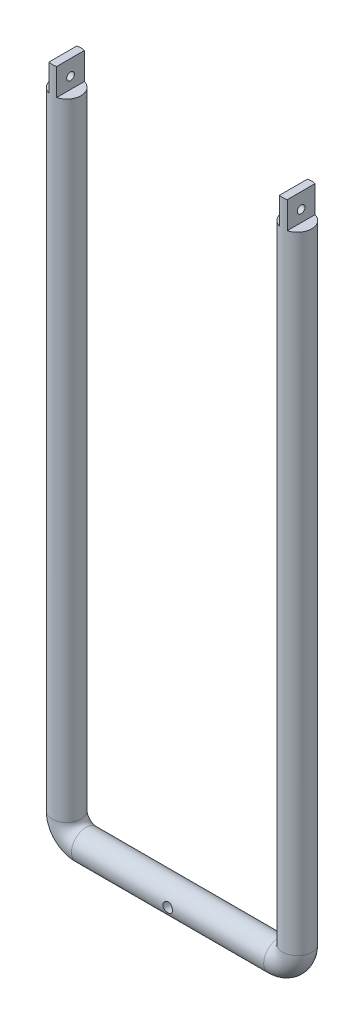
ISO-10303-21;
HEADER;
FILE_DESCRIPTION(('STEP AP214'),'2;1');
FILE_NAME('part.step','',(''),(''),'','','');
FILE_SCHEMA(('AUTOMOTIVE_DESIGN { 1 0 10303 214 1 1 1 1 }'));
ENDSEC;
DATA;
#1=APPLICATION_CONTEXT('core data for automotive mechanical design processes');
#2=APPLICATION_PROTOCOL_DEFINITION('international standard','automotive_design',2000,#1);
#3=PRODUCT_CONTEXT('',#1,'mechanical');
#4=PRODUCT('Part','Part','',(#3));
#5=PRODUCT_RELATED_PRODUCT_CATEGORY('part','',(#4));
#6=PRODUCT_DEFINITION_FORMATION('','',#4);
#7=PRODUCT_DEFINITION_CONTEXT('part definition',#1,'design');
#8=PRODUCT_DEFINITION('design','',#6,#7);
#9=PRODUCT_DEFINITION_SHAPE('','',#8);
#10=(LENGTH_UNIT() NAMED_UNIT(*) SI_UNIT(.MILLI.,.METRE.));
#11=(NAMED_UNIT(*) PLANE_ANGLE_UNIT() SI_UNIT($,.RADIAN.));
#12=(NAMED_UNIT(*) SI_UNIT($,.STERADIAN.) SOLID_ANGLE_UNIT());
#13=UNCERTAINTY_MEASURE_WITH_UNIT(LENGTH_MEASURE(1.E-05),#10,'distance_accuracy_value','');
#14=(GEOMETRIC_REPRESENTATION_CONTEXT(3) GLOBAL_UNCERTAINTY_ASSIGNED_CONTEXT((#13)) GLOBAL_UNIT_ASSIGNED_CONTEXT((#10,
#11,#12)) REPRESENTATION_CONTEXT('',''));
#15=CARTESIAN_POINT('',(0.,0.,0.));
#16=DIRECTION('',(0.,0.,1.));
#17=DIRECTION('',(1.,0.,0.));
#18=AXIS2_PLACEMENT_3D('',#15,#16,#17);
#19=CARTESIAN_POINT('',(-60.,350.,0.));
#20=DIRECTION('',(0.,1.,0.));
#21=DIRECTION('',(0.,0.,-1.));
#22=AXIS2_PLACEMENT_3D('',#19,#20,#21);
#23=PLANE('',#22);
#24=DIRECTION('',(0.,0.,1.));
#25=VECTOR('',#24,1.);
#26=CARTESIAN_POINT('',(-62.,350.,-7.5));
#27=LINE('',#26,#25);
#28=CARTESIAN_POINT('',(-62.,350.,-7.22841614740048));
#29=VERTEX_POINT('',#28);
#30=CARTESIAN_POINT('',(-62.,350.,7.22841614740048));
#31=VERTEX_POINT('',#30);
#32=EDGE_CURVE('E259',#29,#31,#27,.T.);
#33=ORIENTED_EDGE('',*,*,#32,.T.);
#34=CARTESIAN_POINT('',(-60.,350.,0.));
#35=DIRECTION('',(0.,1.,0.));
#36=DIRECTION('',(0.,0.,-1.));
#37=AXIS2_PLACEMENT_3D('',#34,#35,#36);
#38=CIRCLE('',#37,7.5);
#39=CARTESIAN_POINT('',(-58.,350.,7.22841614740046));
#40=VERTEX_POINT('',#39);
#41=EDGE_CURVE('E261',#31,#40,#38,.T.);
#42=ORIENTED_EDGE('',*,*,#41,.T.);
#43=DIRECTION('',(0.,0.,1.));
#44=VECTOR('',#43,1.);
#45=CARTESIAN_POINT('',(-58.,350.,-7.5));
#46=LINE('',#45,#44);
#47=CARTESIAN_POINT('',(-58.,350.,-7.22841614740046));
#48=VERTEX_POINT('',#47);
#49=EDGE_CURVE('E77',#48,#40,#46,.T.);
#50=ORIENTED_EDGE('',*,*,#49,.F.);
#51=EDGE_CURVE('E263',#48,#29,#38,.T.);
#52=ORIENTED_EDGE('',*,*,#51,.T.);
#53=EDGE_LOOP('',(#33,#42,#50,#52));
#54=FACE_BOUND('',#53,.T.);
#55=ADVANCED_FACE('F49',(#54),#23,.T.);
#56=CARTESIAN_POINT('',(60.,350.,0.));
#57=DIRECTION('',(0.,-1.,0.));
#58=DIRECTION('',(0.,0.,-1.));
#59=AXIS2_PLACEMENT_3D('',#56,#57,#58);
#60=PLANE('',#59);
#61=CARTESIAN_POINT('',(60.,350.,0.));
#62=DIRECTION('',(0.,-1.,0.));
#63=DIRECTION('',(0.,0.,-1.));
#64=AXIS2_PLACEMENT_3D('',#61,#62,#63);
#65=CIRCLE('',#64,7.5);
#66=CARTESIAN_POINT('',(58.,350.,-7.22841614740047));
#67=VERTEX_POINT('',#66);
#68=CARTESIAN_POINT('',(62.,350.,-7.22841614740048));
#69=VERTEX_POINT('',#68);
#70=EDGE_CURVE('E138',#67,#69,#65,.T.);
#71=ORIENTED_EDGE('',*,*,#70,.F.);
#72=DIRECTION('',(0.,0.,1.));
#73=VECTOR('',#72,1.);
#74=CARTESIAN_POINT('',(58.,350.,-7.5));
#75=LINE('',#74,#73);
#76=CARTESIAN_POINT('',(58.,350.,7.22841614740047));
#77=VERTEX_POINT('',#76);
#78=EDGE_CURVE('E281',#67,#77,#75,.T.);
#79=ORIENTED_EDGE('',*,*,#78,.T.);
#80=CARTESIAN_POINT('',(62.,350.,7.22841614740048));
#81=VERTEX_POINT('',#80);
#82=EDGE_CURVE('E140',#81,#77,#65,.T.);
#83=ORIENTED_EDGE('',*,*,#82,.F.);
#84=DIRECTION('',(0.,0.,1.));
#85=VECTOR('',#84,1.);
#86=CARTESIAN_POINT('',(62.,350.,-7.5));
#87=LINE('',#86,#85);
#88=EDGE_CURVE('E123',#69,#81,#87,.T.);
#89=ORIENTED_EDGE('',*,*,#88,.F.);
#90=EDGE_LOOP('',(#71,#79,#83,#89));
#91=FACE_BOUND('',#90,.T.);
#92=ADVANCED_FACE('F136',(#91),#60,.F.);
#93=CARTESIAN_POINT('',(-60.,350.,0.));
#94=DIRECTION('',(0.,-1.,0.));
#95=DIRECTION('',(1.,0.,0.));
#96=AXIS2_PLACEMENT_3D('',#93,#94,#95);
#97=CYLINDRICAL_SURFACE('',#96,7.5);
#98=CARTESIAN_POINT('',(-60.,10.,0.));
#99=DIRECTION('',(0.,1.,0.));
#100=DIRECTION('',(0.,0.,-1.));
#101=AXIS2_PLACEMENT_3D('',#98,#99,#100);
#102=CIRCLE('',#101,7.5);
#103=CARTESIAN_POINT('',(-67.4999999999999,10.,0.));
#104=VERTEX_POINT('',#103);
#105=EDGE_CURVE('E267',#104,#104,#102,.T.);
#106=ORIENTED_EDGE('',*,*,#105,.T.);
#107=EDGE_LOOP('',(#106));
#108=FACE_BOUND('',#107,.T.);
#109=ORIENTED_EDGE('',*,*,#41,.F.);
#110=DIRECTION('',(0.,-1.,0.));
#111=VECTOR('',#110,1.);
#112=CARTESIAN_POINT('',(-62.,350.,7.22841614740048));
#113=LINE('',#112,#111);
#114=CARTESIAN_POINT('',(-62.,336.,7.22841614740048));
#115=VERTEX_POINT('',#114);
#116=EDGE_CURVE('E12',#31,#115,#113,.T.);
#117=ORIENTED_EDGE('',*,*,#116,.T.);
#118=CARTESIAN_POINT('',(-60.,336.,0.));
#119=DIRECTION('',(0.,-1.,0.));
#120=DIRECTION('',(0.,0.,-1.));
#121=AXIS2_PLACEMENT_3D('',#118,#119,#120);
#122=CIRCLE('',#121,7.5);
#123=CARTESIAN_POINT('',(-62.,336.,-7.22841614740048));
#124=VERTEX_POINT('',#123);
#125=EDGE_CURVE('E172',#115,#124,#122,.T.);
#126=ORIENTED_EDGE('',*,*,#125,.T.);
#127=DIRECTION('',(0.,-1.,0.));
#128=VECTOR('',#127,1.);
#129=CARTESIAN_POINT('',(-62.,350.,-7.22841614740048));
#130=LINE('',#129,#128);
#131=EDGE_CURVE('E62',#124,#29,#130,.F.);
#132=ORIENTED_EDGE('',*,*,#131,.T.);
#133=ORIENTED_EDGE('',*,*,#51,.F.);
#134=DIRECTION('',(0.,-1.,0.));
#135=VECTOR('',#134,1.);
#136=CARTESIAN_POINT('',(-58.,350.,-7.22841614740046));
#137=LINE('',#136,#135);
#138=CARTESIAN_POINT('',(-58.,336.,-7.22841614740046));
#139=VERTEX_POINT('',#138);
#140=EDGE_CURVE('E169',#48,#139,#137,.T.);
#141=ORIENTED_EDGE('',*,*,#140,.T.);
#142=CARTESIAN_POINT('',(-60.,336.,0.));
#143=DIRECTION('',(0.,-1.,0.));
#144=DIRECTION('',(0.,0.,-1.));
#145=AXIS2_PLACEMENT_3D('',#142,#143,#144);
#146=CIRCLE('',#145,7.5);
#147=CARTESIAN_POINT('',(-58.,336.,7.22841614740046));
#148=VERTEX_POINT('',#147);
#149=EDGE_CURVE('E166',#139,#148,#146,.T.);
#150=ORIENTED_EDGE('',*,*,#149,.T.);
#151=DIRECTION('',(0.,-1.,0.));
#152=VECTOR('',#151,1.);
#153=CARTESIAN_POINT('',(-58.,350.,7.22841614740046));
#154=LINE('',#153,#152);
#155=EDGE_CURVE('E164',#148,#40,#154,.F.);
#156=ORIENTED_EDGE('',*,*,#155,.T.);
#157=EDGE_LOOP('',(#109,#117,#126,#132,#133,#141,#150,#156));
#158=FACE_BOUND('',#157,.T.);
#159=ADVANCED_FACE('F230',(#108,#158),#97,.T.);
#160=CARTESIAN_POINT('',(-50.,10.,0.));
#161=DIRECTION('',(0.,0.,1.));
#162=DIRECTION('',(1.,0.,0.));
#163=AXIS2_PLACEMENT_3D('',#160,#161,#162);
#164=TOROIDAL_SURFACE('',#163,10.,7.5);
#165=CARTESIAN_POINT('',(-49.9999999999999,0.,0.));
#166=DIRECTION('',(-1.,0.,0.));
#167=DIRECTION('',(0.,0.,-1.));
#168=AXIS2_PLACEMENT_3D('',#165,#166,#167);
#169=CIRCLE('',#168,7.5);
#170=CARTESIAN_POINT('',(-49.9999999999999,-7.5,0.));
#171=VERTEX_POINT('',#170);
#172=EDGE_CURVE('E270',#171,#171,#169,.T.);
#173=CARTESIAN_POINT('',(-50.,10.,0.));
#174=DIRECTION('',(0.,0.,1.));
#175=DIRECTION('',(1.,0.,0.));
#176=AXIS2_PLACEMENT_3D('',#173,#174,#175);
#177=CIRCLE('',#176,17.5);
#178=EDGE_CURVE('',#104,#171,#177,.T.);
#179=ORIENTED_EDGE('',*,*,#105,.F.);
#180=ORIENTED_EDGE('',*,*,#172,.T.);
#181=ORIENTED_EDGE('',*,*,#178,.T.);
#182=ORIENTED_EDGE('',*,*,#178,.F.);
#183=EDGE_LOOP('',(#179,#181,#180,#182));
#184=FACE_BOUND('',#183,.T.);
#185=ADVANCED_FACE('F232',(#184),#164,.T.);
#186=CARTESIAN_POINT('',(-49.9999999999999,0.,0.));
#187=DIRECTION('',(1.,0.,0.));
#188=DIRECTION('',(0.,0.,-1.));
#189=AXIS2_PLACEMENT_3D('',#186,#187,#188);
#190=CYLINDRICAL_SURFACE('',#189,7.5);
#191=CARTESIAN_POINT('',(-2.5,0.,-7.5));
#192=CARTESIAN_POINT('',(-2.5000006343291,-0.136408407216808,-7.5000003825236));
#193=CARTESIAN_POINT('',(-2.48879933468196,-0.272812986346375,-7.49624423768862));
#194=CARTESIAN_POINT('',(-2.44442722795695,-0.541604402182431,-7.48163025508202));
#195=CARTESIAN_POINT('',(-2.41125414012769,-0.673990820297044,-7.47077168005381));
#196=CARTESIAN_POINT('',(-2.32420189153988,-0.93083197375444,-7.44313269766107));
#197=CARTESIAN_POINT('',(-2.27035734385182,-1.05529956471509,-7.42636219327133));
#198=CARTESIAN_POINT('',(-2.14364706790413,-1.29343734201331,-7.38861114293354));
#199=CARTESIAN_POINT('',(-2.0707775874935,-1.40710539239676,-7.36762976669445));
#200=CARTESIAN_POINT('',(-1.90543548785312,-1.62435418755567,-7.32285236107513));
#201=CARTESIAN_POINT('',(-1.81242191434877,-1.72750925074577,-7.29898891159462));
#202=CARTESIAN_POINT('',(-1.61058211323359,-1.91708173175521,-7.25150786957804));
#203=CARTESIAN_POINT('',(-1.50175241267872,-2.00349546372366,-7.22789033226373));
#204=CARTESIAN_POINT('',(-1.26753721200885,-2.15956235556965,-7.18283331193184));
#205=CARTESIAN_POINT('',(-1.14176565066969,-2.22866214555258,-7.1614759818922));
#206=CARTESIAN_POINT('',(-0.879559763853633,-2.3445471846943,-7.12438263546503));
#207=CARTESIAN_POINT('',(-0.74312870709314,-2.39133924346691,-7.10864490401864));
#208=CARTESIAN_POINT('',(-0.468316946258224,-2.45968365377291,-7.08528258173443));
#209=CARTESIAN_POINT('',(-0.330156978777339,-2.48203362067942,-7.07740239424028));
#210=CARTESIAN_POINT('',(-0.0518406146102978,-2.50335280833619,-7.06989141573769));
#211=CARTESIAN_POINT('',(0.0883151517729761,-2.5023292540118,-7.07025807556825));
#212=CARTESIAN_POINT('',(0.359841576110053,-2.47754975925855,-7.0789753752045));
#213=CARTESIAN_POINT('',(0.491321007297547,-2.45483478291749,-7.08696039668832));
#214=CARTESIAN_POINT('',(0.748483549017086,-2.38901540712354,-7.10941644311377));
#215=CARTESIAN_POINT('',(0.874165963587675,-2.34590856647968,-7.12388824460269));
#216=CARTESIAN_POINT('',(1.1185318739787,-2.23984764515053,-7.15794777828122));
#217=CARTESIAN_POINT('',(1.23707006367381,-2.17658512176816,-7.17761414482793));
#218=CARTESIAN_POINT('',(1.46217727069932,-2.03222276575785,-7.21981396439316));
#219=CARTESIAN_POINT('',(1.56874281733345,-1.95111778091001,-7.24234824476159));
#220=CARTESIAN_POINT('',(1.77272899540193,-1.76837333170559,-7.28918322919352));
#221=CARTESIAN_POINT('',(1.86938173627267,-1.66588287519078,-7.31351473387107));
#222=CARTESIAN_POINT('',(2.04432816665849,-1.44584892492516,-7.36017345967592));
#223=CARTESIAN_POINT('',(2.12262009541124,-1.32830398915204,-7.38250048845168));
#224=CARTESIAN_POINT('',(2.25924075058767,-1.07986903261567,-7.42292769844484));
#225=CARTESIAN_POINT('',(2.31736372835183,-0.948858191040841,-7.44098375020098));
#226=CARTESIAN_POINT('',(2.41050793488928,-0.678172708411269,-7.47051417861087));
#227=CARTESIAN_POINT('',(2.44553718855859,-0.538501095387384,-7.48199084137198));
#228=CARTESIAN_POINT('',(2.4901391650559,-0.260959573823259,-7.49669067678601));
#229=CARTESIAN_POINT('',(2.50074952293188,-0.123273999662115,-7.5002500458432));
#230=CARTESIAN_POINT('',(2.49916831600383,0.151937674900594,-7.49972256737068));
#231=CARTESIAN_POINT('',(2.48698060005031,0.289463798299126,-7.49563701048406));
#232=CARTESIAN_POINT('',(2.4409702306601,0.556299665760639,-7.48050061792761));
#233=CARTESIAN_POINT('',(2.40778448487626,0.685732017087109,-7.46965496777981));
#234=CARTESIAN_POINT('',(2.32151638883318,0.937139896448934,-7.44229617075175));
#235=CARTESIAN_POINT('',(2.26843150133054,1.05911447127152,-7.42578230116688));
#236=CARTESIAN_POINT('',(2.14232392039803,1.29572074098318,-7.38822328218224));
#237=CARTESIAN_POINT('',(2.06881351679207,1.41007489804287,-7.36707036889465));
#238=CARTESIAN_POINT('',(1.90451462496629,1.62516207533897,-7.32263134790656));
#239=CARTESIAN_POINT('',(1.81372085992059,1.72589091948894,-7.29934458984569));
#240=CARTESIAN_POINT('',(1.61255312248353,1.91563126951575,-7.25192119951112));
#241=CARTESIAN_POINT('',(1.50147693268285,2.00390242311443,-7.2277940271857));
#242=CARTESIAN_POINT('',(1.26557108047278,2.16064380580894,-7.18249933236772));
#243=CARTESIAN_POINT('',(1.14074130341481,2.22911386982753,-7.16133183455006));
#244=CARTESIAN_POINT('',(0.88081746177526,2.3439923260409,-7.12455979478459));
#245=CARTESIAN_POINT('',(0.745744802078085,2.39044533041255,-7.10894401982447));
#246=CARTESIAN_POINT('',(0.469053374889673,2.45973666689839,-7.08527080766124));
#247=CARTESIAN_POINT('',(0.327437586489126,2.48258563738485,-7.07720996559098));
#248=CARTESIAN_POINT('',(0.049507259897709,2.50319070619335,-7.06994647185443));
#249=CARTESIAN_POINT('',(-0.0867058507170585,2.502175643271,-7.07031000643538));
#250=CARTESIAN_POINT('',(-0.356912687305157,2.47810573362173,-7.07878174559668));
#251=CARTESIAN_POINT('',(-0.490906544887722,2.45505219864646,-7.08688948923404));
#252=CARTESIAN_POINT('',(-0.750339157506181,2.38842953282336,-7.10961310762229));
#253=CARTESIAN_POINT('',(-0.875892062511242,2.34525836503879,-7.12410245056194));
#254=CARTESIAN_POINT('',(-1.11806851734567,2.23994841439937,-7.15790997046171));
#255=CARTESIAN_POINT('',(-1.23469007797002,2.17780542138451,-7.17722921908483));
#256=CARTESIAN_POINT('',(-1.46120917480728,2.03315173145857,-7.21957073065116));
#257=CARTESIAN_POINT('',(-1.57059125474596,1.94987060691145,-7.24271779105343));
#258=CARTESIAN_POINT('',(-1.7742245334605,1.76660720783912,-7.28958390708132));
#259=CARTESIAN_POINT('',(-1.86847143922019,1.6666202111287,-7.31330312280931));
#260=CARTESIAN_POINT('',(-2.04286103072295,1.44810389230172,-7.3597507631386));
#261=CARTESIAN_POINT('',(-2.1223108693775,1.32900378374932,-7.38240454503142));
#262=CARTESIAN_POINT('',(-2.25997607212662,1.07839339351656,-7.4231497793153));
#263=CARTESIAN_POINT('',(-2.31819686480511,0.946886295330871,-7.44124239769824));
#264=CARTESIAN_POINT('',(-2.40930408122168,0.681234118002439,-7.47013787671355));
#265=CARTESIAN_POINT('',(-2.44320616565844,0.547469394191021,-7.48123031056307));
#266=CARTESIAN_POINT('',(-2.48855070169282,0.275801040025617,-7.49616017660554));
#267=CARTESIAN_POINT('',(-2.49999935874134,0.137898563921866,-7.49999961329762));
#268=CARTESIAN_POINT('',(-2.5,0.,-7.5));
#269=B_SPLINE_CURVE_WITH_KNOTS('',3,(#191,#192,#193,#194,#195,#196,#197,#198,#199,#200,#201,
#202,#203,#204,#205,#206,#207,#208,#209,#210,#211,#212,#213,#214,#215,#216,#217,#218,#219,#220,
#221,#222,#223,#224,#225,#226,#227,#228,#229,#230,#231,#232,#233,#234,#235,#236,#237,#238,#239,
#240,#241,#242,#243,#244,#245,#246,#247,#248,#249,#250,#251,#252,#253,#254,#255,#256,#257,#258,
#259,#260,#261,#262,#263,#264,#265,#266,#267,#268),.UNSPECIFIED.,.T.,.F.,(4,2,2,2,2,2,2,2,2,2,2,
2,2,2,2,2,2,2,2,2,2,2,2,2,2,2,2,2,2,2,2,2,2,2,2,2,2,2,4),(0.,0.408717765065027,
0.817477963168802,1.22555668217568,1.63371594449775,2.0546171070689,2.47561083218826,
2.90870962058676,3.34167611732083,3.760048143546,4.17829084968714,4.57742066378201,
4.97659827138705,5.38220427887827,5.78792756395518,6.21483264528417,6.64177864916546,
7.07296014125894,7.50399172193021,7.91633957937924,8.32861782910441,8.72895394945534,
9.1293411321026,9.54025999609341,9.95130452054728,10.3810255720188,10.8107502058749,
11.2396003456693,11.668257117646,12.0748916516065,12.4815019837844,12.8803896770104,
13.2793659543994,13.6957516672951,14.1122552780945,14.5449915208775,14.9776170288114,
15.3909139593453,15.8040966509535),.UNSPECIFIED.);
#270=CARTESIAN_POINT('',(-2.5,0.,-7.5));
#271=VERTEX_POINT('',#270);
#272=EDGE_CURVE('E52',#271,#271,#269,.T.);
#273=ORIENTED_EDGE('',*,*,#272,.T.);
#274=EDGE_LOOP('',(#273));
#275=FACE_BOUND('',#274,.T.);
#276=CARTESIAN_POINT('',(2.5,0.,7.5));
#277=CARTESIAN_POINT('',(2.5000006343291,-0.136408407216808,7.5000003825236));
#278=CARTESIAN_POINT('',(2.48879933468196,-0.272812986346375,7.49624423768862));
#279=CARTESIAN_POINT('',(2.44442722795695,-0.541604402182431,7.48163025508202));
#280=CARTESIAN_POINT('',(2.41125414012769,-0.673990820297044,7.47077168005381));
#281=CARTESIAN_POINT('',(2.32420189153988,-0.93083197375444,7.44313269766107));
#282=CARTESIAN_POINT('',(2.27035734385182,-1.05529956471509,7.42636219327133));
#283=CARTESIAN_POINT('',(2.14364706790413,-1.29343734201331,7.38861114293354));
#284=CARTESIAN_POINT('',(2.0707775874935,-1.40710539239676,7.36762976669445));
#285=CARTESIAN_POINT('',(1.90543548785312,-1.62435418755567,7.32285236107513));
#286=CARTESIAN_POINT('',(1.81242191434877,-1.72750925074577,7.29898891159462));
#287=CARTESIAN_POINT('',(1.61058211323359,-1.91708173175521,7.25150786957804));
#288=CARTESIAN_POINT('',(1.50175241267872,-2.00349546372366,7.22789033226373));
#289=CARTESIAN_POINT('',(1.26753721200885,-2.15956235556965,7.18283331193184));
#290=CARTESIAN_POINT('',(1.14176565066969,-2.22866214555258,7.1614759818922));
#291=CARTESIAN_POINT('',(0.879559763853633,-2.3445471846943,7.12438263546503));
#292=CARTESIAN_POINT('',(0.74312870709314,-2.39133924346691,7.10864490401864));
#293=CARTESIAN_POINT('',(0.468316946258224,-2.45968365377291,7.08528258173443));
#294=CARTESIAN_POINT('',(0.330156978777339,-2.48203362067942,7.07740239424028));
#295=CARTESIAN_POINT('',(0.0518406146102978,-2.50335280833619,7.06989141573769));
#296=CARTESIAN_POINT('',(-0.0883151517729761,-2.5023292540118,7.07025807556825));
#297=CARTESIAN_POINT('',(-0.359841576110053,-2.47754975925855,7.0789753752045));
#298=CARTESIAN_POINT('',(-0.491321007297547,-2.45483478291749,7.08696039668832));
#299=CARTESIAN_POINT('',(-0.748483549017086,-2.38901540712354,7.10941644311377));
#300=CARTESIAN_POINT('',(-0.874165963587675,-2.34590856647968,7.12388824460269));
#301=CARTESIAN_POINT('',(-1.1185318739787,-2.23984764515053,7.15794777828122));
#302=CARTESIAN_POINT('',(-1.23707006367381,-2.17658512176816,7.17761414482793));
#303=CARTESIAN_POINT('',(-1.46217727069932,-2.03222276575785,7.21981396439316));
#304=CARTESIAN_POINT('',(-1.56874281733345,-1.95111778091001,7.24234824476159));
#305=CARTESIAN_POINT('',(-1.77272899540193,-1.76837333170559,7.28918322919352));
#306=CARTESIAN_POINT('',(-1.86938173627267,-1.66588287519078,7.31351473387107));
#307=CARTESIAN_POINT('',(-2.04432816665849,-1.44584892492516,7.36017345967592));
#308=CARTESIAN_POINT('',(-2.12262009541124,-1.32830398915204,7.38250048845168));
#309=CARTESIAN_POINT('',(-2.25924075058767,-1.07986903261567,7.42292769844484));
#310=CARTESIAN_POINT('',(-2.31736372835183,-0.948858191040841,7.44098375020098));
#311=CARTESIAN_POINT('',(-2.41050793488928,-0.678172708411269,7.47051417861087));
#312=CARTESIAN_POINT('',(-2.44553718855859,-0.538501095387384,7.48199084137198));
#313=CARTESIAN_POINT('',(-2.4901391650559,-0.260959573823259,7.49669067678601));
#314=CARTESIAN_POINT('',(-2.50074952293188,-0.123273999662115,7.5002500458432));
#315=CARTESIAN_POINT('',(-2.49916831600383,0.151937674900594,7.49972256737068));
#316=CARTESIAN_POINT('',(-2.48698060005031,0.289463798299126,7.49563701048406));
#317=CARTESIAN_POINT('',(-2.4409702306601,0.556299665760639,7.48050061792761));
#318=CARTESIAN_POINT('',(-2.40778448487626,0.685732017087109,7.46965496777981));
#319=CARTESIAN_POINT('',(-2.32151638883318,0.937139896448934,7.44229617075175));
#320=CARTESIAN_POINT('',(-2.26843150133054,1.05911447127152,7.42578230116688));
#321=CARTESIAN_POINT('',(-2.14232392039803,1.29572074098318,7.38822328218224));
#322=CARTESIAN_POINT('',(-2.06881351679207,1.41007489804287,7.36707036889465));
#323=CARTESIAN_POINT('',(-1.90451462496629,1.62516207533897,7.32263134790656));
#324=CARTESIAN_POINT('',(-1.81372085992059,1.72589091948894,7.29934458984569));
#325=CARTESIAN_POINT('',(-1.61255312248353,1.91563126951575,7.25192119951112));
#326=CARTESIAN_POINT('',(-1.50147693268285,2.00390242311443,7.2277940271857));
#327=CARTESIAN_POINT('',(-1.26557108047278,2.16064380580894,7.18249933236772));
#328=CARTESIAN_POINT('',(-1.14074130341481,2.22911386982753,7.16133183455006));
#329=CARTESIAN_POINT('',(-0.88081746177526,2.3439923260409,7.12455979478459));
#330=CARTESIAN_POINT('',(-0.745744802078085,2.39044533041255,7.10894401982447));
#331=CARTESIAN_POINT('',(-0.469053374889673,2.45973666689839,7.08527080766124));
#332=CARTESIAN_POINT('',(-0.327437586489126,2.48258563738485,7.07720996559098));
#333=CARTESIAN_POINT('',(-0.049507259897709,2.50319070619335,7.06994647185443));
#334=CARTESIAN_POINT('',(0.0867058507170585,2.502175643271,7.07031000643538));
#335=CARTESIAN_POINT('',(0.356912687305157,2.47810573362173,7.07878174559668));
#336=CARTESIAN_POINT('',(0.490906544887722,2.45505219864646,7.08688948923404));
#337=CARTESIAN_POINT('',(0.750339157506181,2.38842953282336,7.10961310762229));
#338=CARTESIAN_POINT('',(0.875892062511242,2.34525836503879,7.12410245056194));
#339=CARTESIAN_POINT('',(1.11806851734567,2.23994841439937,7.15790997046171));
#340=CARTESIAN_POINT('',(1.23469007797002,2.17780542138451,7.17722921908483));
#341=CARTESIAN_POINT('',(1.46120917480728,2.03315173145857,7.21957073065116));
#342=CARTESIAN_POINT('',(1.57059125474596,1.94987060691145,7.24271779105343));
#343=CARTESIAN_POINT('',(1.7742245334605,1.76660720783912,7.28958390708132));
#344=CARTESIAN_POINT('',(1.86847143922019,1.6666202111287,7.31330312280931));
#345=CARTESIAN_POINT('',(2.04286103072295,1.44810389230172,7.3597507631386));
#346=CARTESIAN_POINT('',(2.1223108693775,1.32900378374932,7.38240454503142));
#347=CARTESIAN_POINT('',(2.25997607212662,1.07839339351656,7.4231497793153));
#348=CARTESIAN_POINT('',(2.31819686480511,0.946886295330871,7.44124239769824));
#349=CARTESIAN_POINT('',(2.40930408122168,0.681234118002439,7.47013787671355));
#350=CARTESIAN_POINT('',(2.44320616565844,0.547469394191021,7.48123031056307));
#351=CARTESIAN_POINT('',(2.48855070169282,0.275801040025617,7.49616017660554));
#352=CARTESIAN_POINT('',(2.49999935874134,0.137898563921866,7.49999961329762));
#353=CARTESIAN_POINT('',(2.5,0.,7.5));
#354=B_SPLINE_CURVE_WITH_KNOTS('',3,(#276,#277,#278,#279,#280,#281,#282,#283,#284,#285,#286,
#287,#288,#289,#290,#291,#292,#293,#294,#295,#296,#297,#298,#299,#300,#301,#302,#303,#304,#305,
#306,#307,#308,#309,#310,#311,#312,#313,#314,#315,#316,#317,#318,#319,#320,#321,#322,#323,#324,
#325,#326,#327,#328,#329,#330,#331,#332,#333,#334,#335,#336,#337,#338,#339,#340,#341,#342,#343,
#344,#345,#346,#347,#348,#349,#350,#351,#352,#353),.UNSPECIFIED.,.T.,.F.,(4,2,2,2,2,2,2,2,2,2,2,
2,2,2,2,2,2,2,2,2,2,2,2,2,2,2,2,2,2,2,2,2,2,2,2,2,2,2,4),(0.,0.408717765065027,
0.817477963168802,1.22555668217568,1.63371594449775,2.0546171070689,2.47561083218826,
2.90870962058676,3.34167611732083,3.760048143546,4.17829084968714,4.57742066378201,
4.97659827138705,5.38220427887827,5.78792756395518,6.21483264528417,6.64177864916546,
7.07296014125894,7.50399172193021,7.91633957937924,8.32861782910441,8.72895394945534,
9.1293411321026,9.54025999609341,9.95130452054728,10.3810255720188,10.8107502058749,
11.2396003456693,11.668257117646,12.0748916516065,12.4815019837844,12.8803896770104,
13.2793659543994,13.6957516672951,14.1122552780945,14.5449915208775,14.9776170288114,
15.3909139593453,15.8040966509535),.UNSPECIFIED.);
#355=CARTESIAN_POINT('',(2.5,0.,7.5));
#356=VERTEX_POINT('',#355);
#357=EDGE_CURVE('E180',#356,#356,#354,.T.);
#358=ORIENTED_EDGE('',*,*,#357,.T.);
#359=EDGE_LOOP('',(#358));
#360=FACE_BOUND('',#359,.T.);
#361=CARTESIAN_POINT('',(50.,0.,0.));
#362=DIRECTION('',(-1.,0.,0.));
#363=DIRECTION('',(0.,0.,-1.));
#364=AXIS2_PLACEMENT_3D('',#361,#362,#363);
#365=CIRCLE('',#364,7.5);
#366=CARTESIAN_POINT('',(50.,-7.5,0.));
#367=VERTEX_POINT('',#366);
#368=EDGE_CURVE('E153',#367,#367,#365,.T.);
#369=ORIENTED_EDGE('',*,*,#368,.T.);
#370=EDGE_LOOP('',(#369));
#371=FACE_BOUND('',#370,.T.);
#372=ORIENTED_EDGE('',*,*,#172,.F.);
#373=EDGE_LOOP('',(#372));
#374=FACE_BOUND('',#373,.T.);
#375=ADVANCED_FACE('F185',(#275,#360,#371,#374),#190,.T.);
#376=CARTESIAN_POINT('',(50.,10.,0.));
#377=DIRECTION('',(0.,0.,1.));
#378=DIRECTION('',(1.,0.,0.));
#379=AXIS2_PLACEMENT_3D('',#376,#377,#378);
#380=TOROIDAL_SURFACE('',#379,10.,7.5);
#381=CARTESIAN_POINT('',(60.,10.,0.));
#382=DIRECTION('',(0.,-1.,0.));
#383=DIRECTION('',(0.,0.,-1.));
#384=AXIS2_PLACEMENT_3D('',#381,#382,#383);
#385=CIRCLE('',#384,7.5);
#386=CARTESIAN_POINT('',(67.5,10.,0.));
#387=VERTEX_POINT('',#386);
#388=EDGE_CURVE('E149',#387,#387,#385,.T.);
#389=CARTESIAN_POINT('',(50.,10.,0.));
#390=DIRECTION('',(0.,0.,1.));
#391=DIRECTION('',(1.,0.,0.));
#392=AXIS2_PLACEMENT_3D('',#389,#390,#391);
#393=CIRCLE('',#392,17.5);
#394=EDGE_CURVE('',#367,#387,#393,.T.);
#395=ORIENTED_EDGE('',*,*,#368,.F.);
#396=ORIENTED_EDGE('',*,*,#388,.T.);
#397=ORIENTED_EDGE('',*,*,#394,.T.);
#398=ORIENTED_EDGE('',*,*,#394,.F.);
#399=EDGE_LOOP('',(#395,#397,#396,#398));
#400=FACE_BOUND('',#399,.T.);
#401=ADVANCED_FACE('F239',(#400),#380,.T.);
#402=CARTESIAN_POINT('',(60.,10.,0.));
#403=DIRECTION('',(0.,1.,0.));
#404=DIRECTION('',(-1.,0.,0.));
#405=AXIS2_PLACEMENT_3D('',#402,#403,#404);
#406=CYLINDRICAL_SURFACE('',#405,7.5);
#407=ORIENTED_EDGE('',*,*,#82,.T.);
#408=DIRECTION('',(0.,1.,0.));
#409=VECTOR('',#408,1.);
#410=CARTESIAN_POINT('',(58.,10.,7.22841614740046));
#411=LINE('',#410,#409);
#412=CARTESIAN_POINT('',(58.,336.,7.22841614740047));
#413=VERTEX_POINT('',#412);
#414=EDGE_CURVE('E161',#77,#413,#411,.F.);
#415=ORIENTED_EDGE('',*,*,#414,.T.);
#416=CARTESIAN_POINT('',(60.,336.,0.));
#417=DIRECTION('',(0.,-1.,0.));
#418=DIRECTION('',(0.,0.,-1.));
#419=AXIS2_PLACEMENT_3D('',#416,#417,#418);
#420=CIRCLE('',#419,7.5);
#421=CARTESIAN_POINT('',(58.,336.,-7.22841614740047));
#422=VERTEX_POINT('',#421);
#423=EDGE_CURVE('E130',#413,#422,#420,.T.);
#424=ORIENTED_EDGE('',*,*,#423,.T.);
#425=DIRECTION('',(0.,1.,0.));
#426=VECTOR('',#425,1.);
#427=CARTESIAN_POINT('',(58.,10.,-7.22841614740046));
#428=LINE('',#427,#426);
#429=EDGE_CURVE('E148',#422,#67,#428,.T.);
#430=ORIENTED_EDGE('',*,*,#429,.T.);
#431=ORIENTED_EDGE('',*,*,#70,.T.);
#432=DIRECTION('',(0.,1.,0.));
#433=VECTOR('',#432,1.);
#434=CARTESIAN_POINT('',(62.,10.,-7.22841614740048));
#435=LINE('',#434,#433);
#436=CARTESIAN_POINT('',(62.,336.,-7.22841614740048));
#437=VERTEX_POINT('',#436);
#438=EDGE_CURVE('E120',#69,#437,#435,.F.);
#439=ORIENTED_EDGE('',*,*,#438,.T.);
#440=CARTESIAN_POINT('',(60.,336.,0.));
#441=DIRECTION('',(0.,-1.,0.));
#442=DIRECTION('',(0.,0.,-1.));
#443=AXIS2_PLACEMENT_3D('',#440,#441,#442);
#444=CIRCLE('',#443,7.5);
#445=CARTESIAN_POINT('',(62.,336.,7.22841614740048));
#446=VERTEX_POINT('',#445);
#447=EDGE_CURVE('E151',#437,#446,#444,.T.);
#448=ORIENTED_EDGE('',*,*,#447,.T.);
#449=DIRECTION('',(0.,1.,0.));
#450=VECTOR('',#449,1.);
#451=CARTESIAN_POINT('',(62.,10.,7.22841614740048));
#452=LINE('',#451,#450);
#453=EDGE_CURVE('E131',#446,#81,#452,.T.);
#454=ORIENTED_EDGE('',*,*,#453,.T.);
#455=EDGE_LOOP('',(#407,#415,#424,#430,#431,#439,#448,#454));
#456=FACE_BOUND('',#455,.T.);
#457=ORIENTED_EDGE('',*,*,#388,.F.);
#458=EDGE_LOOP('',(#457));
#459=FACE_BOUND('',#458,.T.);
#460=ADVANCED_FACE('F144',(#456,#459),#406,.T.);
#461=CARTESIAN_POINT('',(67.5,336.,-7.5));
#462=DIRECTION('',(0.,-1.,0.));
#463=DIRECTION('',(0.,0.,-1.));
#464=AXIS2_PLACEMENT_3D('',#461,#462,#463);
#465=PLANE('',#464);
#466=DIRECTION('',(0.,0.,1.));
#467=VECTOR('',#466,1.);
#468=CARTESIAN_POINT('',(62.,336.,-7.5));
#469=LINE('',#468,#467);
#470=EDGE_CURVE('E126',#437,#446,#469,.T.);
#471=ORIENTED_EDGE('',*,*,#470,.T.);
#472=ORIENTED_EDGE('',*,*,#447,.F.);
#473=EDGE_LOOP('',(#471,#472));
#474=FACE_BOUND('',#473,.T.);
#475=ADVANCED_FACE('F225',(#474),#465,.F.);
#476=CARTESIAN_POINT('',(62.,336.,-7.5));
#477=DIRECTION('',(-1.,0.,0.));
#478=DIRECTION('',(0.,0.,1.));
#479=AXIS2_PLACEMENT_3D('',#476,#477,#478);
#480=PLANE('',#479);
#481=CARTESIAN_POINT('',(62.,342.,0.));
#482=DIRECTION('',(-1.,0.,0.));
#483=DIRECTION('',(0.,0.,1.));
#484=AXIS2_PLACEMENT_3D('',#481,#482,#483);
#485=CIRCLE('',#484,2.);
#486=CARTESIAN_POINT('',(62.,342.,2.));
#487=VERTEX_POINT('',#486);
#488=EDGE_CURVE('E141',#487,#487,#485,.T.);
#489=ORIENTED_EDGE('',*,*,#488,.T.);
#490=EDGE_LOOP('',(#489));
#491=FACE_BOUND('',#490,.T.);
#492=ORIENTED_EDGE('',*,*,#470,.F.);
#493=ORIENTED_EDGE('',*,*,#438,.F.);
#494=ORIENTED_EDGE('',*,*,#88,.T.);
#495=ORIENTED_EDGE('',*,*,#453,.F.);
#496=EDGE_LOOP('',(#492,#493,#494,#495));
#497=FACE_BOUND('',#496,.T.);
#498=ADVANCED_FACE('F122',(#491,#497),#480,.F.);
#499=CARTESIAN_POINT('',(58.,336.,-7.5));
#500=DIRECTION('',(1.,0.,0.));
#501=DIRECTION('',(0.,0.,-1.));
#502=AXIS2_PLACEMENT_3D('',#499,#500,#501);
#503=PLANE('',#502);
#504=CARTESIAN_POINT('',(57.9999999999999,342.,0.));
#505=DIRECTION('',(1.,0.,0.));
#506=DIRECTION('',(0.,0.,-1.));
#507=AXIS2_PLACEMENT_3D('',#504,#505,#506);
#508=CIRCLE('',#507,2.);
#509=CARTESIAN_POINT('',(57.9999999999999,342.,-2.));
#510=VERTEX_POINT('',#509);
#511=EDGE_CURVE('E293',#510,#510,#508,.T.);
#512=ORIENTED_EDGE('',*,*,#511,.T.);
#513=EDGE_LOOP('',(#512));
#514=FACE_BOUND('',#513,.T.);
#515=DIRECTION('',(0.,0.,1.));
#516=VECTOR('',#515,1.);
#517=CARTESIAN_POINT('',(58.,336.,-7.5));
#518=LINE('',#517,#516);
#519=EDGE_CURVE('E283',#422,#413,#518,.T.);
#520=ORIENTED_EDGE('',*,*,#519,.T.);
#521=ORIENTED_EDGE('',*,*,#414,.F.);
#522=ORIENTED_EDGE('',*,*,#78,.F.);
#523=ORIENTED_EDGE('',*,*,#429,.F.);
#524=EDGE_LOOP('',(#520,#521,#522,#523));
#525=FACE_BOUND('',#524,.T.);
#526=ADVANCED_FACE('F218',(#514,#525),#503,.F.);
#527=CARTESIAN_POINT('',(52.5,336.,-7.5));
#528=DIRECTION('',(0.,-1.,0.));
#529=DIRECTION('',(0.,0.,-1.));
#530=AXIS2_PLACEMENT_3D('',#527,#528,#529);
#531=PLANE('',#530);
#532=ORIENTED_EDGE('',*,*,#519,.F.);
#533=ORIENTED_EDGE('',*,*,#423,.F.);
#534=EDGE_LOOP('',(#532,#533));
#535=FACE_BOUND('',#534,.T.);
#536=ADVANCED_FACE('F211',(#535),#531,.F.);
#537=CARTESIAN_POINT('',(-52.5,336.,-7.5));
#538=DIRECTION('',(0.,-1.,0.));
#539=DIRECTION('',(0.,0.,-1.));
#540=AXIS2_PLACEMENT_3D('',#537,#538,#539);
#541=PLANE('',#540);
#542=DIRECTION('',(0.,0.,1.));
#543=VECTOR('',#542,1.);
#544=CARTESIAN_POINT('',(-58.,336.,-7.5));
#545=LINE('',#544,#543);
#546=EDGE_CURVE('E287',#139,#148,#545,.T.);
#547=ORIENTED_EDGE('',*,*,#546,.T.);
#548=ORIENTED_EDGE('',*,*,#149,.F.);
#549=EDGE_LOOP('',(#547,#548));
#550=FACE_BOUND('',#549,.T.);
#551=ADVANCED_FACE('F208',(#550),#541,.F.);
#552=CARTESIAN_POINT('',(-58.,336.,-7.5));
#553=DIRECTION('',(-1.,0.,0.));
#554=DIRECTION('',(0.,0.,1.));
#555=AXIS2_PLACEMENT_3D('',#552,#553,#554);
#556=PLANE('',#555);
#557=CARTESIAN_POINT('',(-58.,342.,0.));
#558=DIRECTION('',(-1.,0.,0.));
#559=DIRECTION('',(0.,0.,1.));
#560=AXIS2_PLACEMENT_3D('',#557,#558,#559);
#561=CIRCLE('',#560,2.);
#562=CARTESIAN_POINT('',(-58.,342.,2.));
#563=VERTEX_POINT('',#562);
#564=EDGE_CURVE('E179',#563,#563,#561,.T.);
#565=ORIENTED_EDGE('',*,*,#564,.T.);
#566=EDGE_LOOP('',(#565));
#567=FACE_BOUND('',#566,.T.);
#568=ORIENTED_EDGE('',*,*,#49,.T.);
#569=ORIENTED_EDGE('',*,*,#155,.F.);
#570=ORIENTED_EDGE('',*,*,#546,.F.);
#571=ORIENTED_EDGE('',*,*,#140,.F.);
#572=EDGE_LOOP('',(#568,#569,#570,#571));
#573=FACE_BOUND('',#572,.T.);
#574=ADVANCED_FACE('F204',(#567,#573),#556,.F.);
#575=CARTESIAN_POINT('',(-62.,336.,-7.5));
#576=DIRECTION('',(1.,0.,0.));
#577=DIRECTION('',(0.,0.,-1.));
#578=AXIS2_PLACEMENT_3D('',#575,#576,#577);
#579=PLANE('',#578);
#580=CARTESIAN_POINT('',(-62.,342.,0.));
#581=DIRECTION('',(1.,0.,0.));
#582=DIRECTION('',(0.,0.,-1.));
#583=AXIS2_PLACEMENT_3D('',#580,#581,#582);
#584=CIRCLE('',#583,2.);
#585=CARTESIAN_POINT('',(-62.,342.,-2.));
#586=VERTEX_POINT('',#585);
#587=EDGE_CURVE('E177',#586,#586,#584,.T.);
#588=ORIENTED_EDGE('',*,*,#587,.T.);
#589=EDGE_LOOP('',(#588));
#590=FACE_BOUND('',#589,.T.);
#591=ORIENTED_EDGE('',*,*,#32,.F.);
#592=ORIENTED_EDGE('',*,*,#131,.F.);
#593=DIRECTION('',(0.,0.,1.));
#594=VECTOR('',#593,1.);
#595=CARTESIAN_POINT('',(-62.,336.,-7.5));
#596=LINE('',#595,#594);
#597=EDGE_CURVE('E69',#124,#115,#596,.T.);
#598=ORIENTED_EDGE('',*,*,#597,.T.);
#599=ORIENTED_EDGE('',*,*,#116,.F.);
#600=EDGE_LOOP('',(#591,#592,#598,#599));
#601=FACE_BOUND('',#600,.T.);
#602=ADVANCED_FACE('F200',(#590,#601),#579,.F.);
#603=CARTESIAN_POINT('',(-67.5,336.,-7.5));
#604=DIRECTION('',(0.,-1.,0.));
#605=DIRECTION('',(0.,0.,-1.));
#606=AXIS2_PLACEMENT_3D('',#603,#604,#605);
#607=PLANE('',#606);
#608=ORIENTED_EDGE('',*,*,#597,.F.);
#609=ORIENTED_EDGE('',*,*,#125,.F.);
#610=EDGE_LOOP('',(#608,#609));
#611=FACE_BOUND('',#610,.T.);
#612=ADVANCED_FACE('F203',(#611),#607,.F.);
#613=CARTESIAN_POINT('',(-65.,342.,0.));
#614=DIRECTION('',(1.,0.,0.));
#615=DIRECTION('',(0.,0.,-1.));
#616=AXIS2_PLACEMENT_3D('',#613,#614,#615);
#617=CYLINDRICAL_SURFACE('',#616,2.);
#618=ORIENTED_EDGE('',*,*,#587,.F.);
#619=EDGE_LOOP('',(#618));
#620=FACE_BOUND('',#619,.T.);
#621=ORIENTED_EDGE('',*,*,#564,.F.);
#622=EDGE_LOOP('',(#621));
#623=FACE_BOUND('',#622,.T.);
#624=ADVANCED_FACE('F198',(#620,#623),#617,.F.);
#625=ORIENTED_EDGE('',*,*,#511,.F.);
#626=EDGE_LOOP('',(#625));
#627=FACE_BOUND('',#626,.T.);
#628=ORIENTED_EDGE('',*,*,#488,.F.);
#629=EDGE_LOOP('',(#628));
#630=FACE_BOUND('',#629,.T.);
#631=ADVANCED_FACE('F193',(#627,#630),#617,.F.);
#632=CARTESIAN_POINT('',(0.,0.,-10.));
#633=DIRECTION('',(0.,0.,1.));
#634=DIRECTION('',(1.,0.,0.));
#635=AXIS2_PLACEMENT_3D('',#632,#633,#634);
#636=CYLINDRICAL_SURFACE('',#635,2.5);
#637=ORIENTED_EDGE('',*,*,#357,.F.);
#638=EDGE_LOOP('',(#637));
#639=FACE_BOUND('',#638,.T.);
#640=ORIENTED_EDGE('',*,*,#272,.F.);
#641=EDGE_LOOP('',(#640));
#642=FACE_BOUND('',#641,.T.);
#643=ADVANCED_FACE('F189',(#639,#642),#636,.F.);
#644=CLOSED_SHELL('',(#55,#92,#159,#185,#375,#401,#460,#475,#498,#526,#536,#551,#574,#602,#612,
#624,#631,#643));
#645=MANIFOLD_SOLID_BREP('B2',#644);
#646=ADVANCED_BREP_SHAPE_REPRESENTATION('',(#18,#645),#14);
#647=SHAPE_DEFINITION_REPRESENTATION(#9,#646);
ENDSEC;
END-ISO-10303-21;
